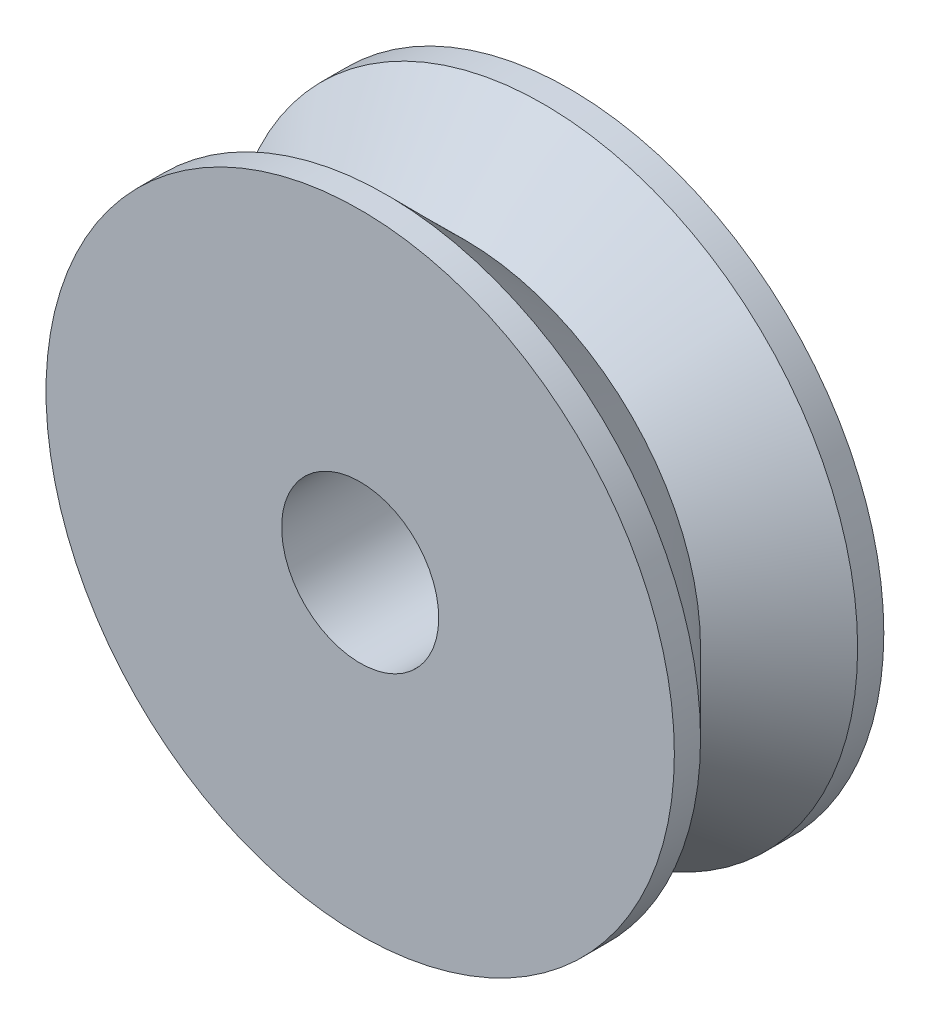
ISO-10303-21;
HEADER;
FILE_DESCRIPTION(('STEP AP214'),'2;1');
FILE_NAME('part.step','',(''),(''),'','','');
FILE_SCHEMA(('AUTOMOTIVE_DESIGN { 1 0 10303 214 1 1 1 1 }'));
ENDSEC;
DATA;
#1=APPLICATION_CONTEXT('core data for automotive mechanical design processes');
#2=APPLICATION_PROTOCOL_DEFINITION('international standard','automotive_design',2000,#1);
#3=PRODUCT_CONTEXT('',#1,'mechanical');
#4=PRODUCT('Part','Part','',(#3));
#5=PRODUCT_RELATED_PRODUCT_CATEGORY('part','',(#4));
#6=PRODUCT_DEFINITION_FORMATION('','',#4);
#7=PRODUCT_DEFINITION_CONTEXT('part definition',#1,'design');
#8=PRODUCT_DEFINITION('design','',#6,#7);
#9=PRODUCT_DEFINITION_SHAPE('','',#8);
#10=(LENGTH_UNIT() NAMED_UNIT(*) SI_UNIT(.MILLI.,.METRE.));
#11=(NAMED_UNIT(*) PLANE_ANGLE_UNIT() SI_UNIT($,.RADIAN.));
#12=(NAMED_UNIT(*) SI_UNIT($,.STERADIAN.) SOLID_ANGLE_UNIT());
#13=UNCERTAINTY_MEASURE_WITH_UNIT(LENGTH_MEASURE(1.E-05),#10,'distance_accuracy_value','');
#14=(GEOMETRIC_REPRESENTATION_CONTEXT(3) GLOBAL_UNCERTAINTY_ASSIGNED_CONTEXT((#13)) GLOBAL_UNIT_ASSIGNED_CONTEXT((#10,
#11,#12)) REPRESENTATION_CONTEXT('',''));
#15=CARTESIAN_POINT('',(0.,0.,0.));
#16=DIRECTION('',(0.,0.,1.));
#17=DIRECTION('',(1.,0.,0.));
#18=AXIS2_PLACEMENT_3D('',#15,#16,#17);
#19=CARTESIAN_POINT('',(0.,0.,0.));
#20=DIRECTION('',(0.,0.,1.));
#21=DIRECTION('',(1.,0.,0.));
#22=AXIS2_PLACEMENT_3D('',#19,#20,#21);
#23=PLANE('',#22);
#24=CARTESIAN_POINT('',(0.,0.,0.));
#25=DIRECTION('',(0.,0.,1.));
#26=DIRECTION('',(1.,0.,0.));
#27=AXIS2_PLACEMENT_3D('',#24,#25,#26);
#28=CIRCLE('',#27,5.99999999999908);
#29=CARTESIAN_POINT('',(5.99999999999908,0.,0.));
#30=VERTEX_POINT('',#29);
#31=EDGE_CURVE('E47',#30,#30,#28,.T.);
#32=ORIENTED_EDGE('',*,*,#31,.F.);
#33=EDGE_LOOP('',(#32));
#34=FACE_BOUND('',#33,.T.);
#35=CARTESIAN_POINT('',(0.,0.,0.));
#36=DIRECTION('',(0.,0.,1.));
#37=DIRECTION('',(1.,0.,0.));
#38=AXIS2_PLACEMENT_3D('',#35,#36,#37);
#39=CIRCLE('',#38,1.49999999999906);
#40=CARTESIAN_POINT('',(1.49999999999906,0.,0.));
#41=VERTEX_POINT('',#40);
#42=EDGE_CURVE('E52',#41,#41,#39,.T.);
#43=ORIENTED_EDGE('',*,*,#42,.T.);
#44=EDGE_LOOP('',(#43));
#45=FACE_BOUND('',#44,.T.);
#46=ADVANCED_FACE('F32',(#34,#45),#23,.F.);
#47=CARTESIAN_POINT('',(0.,0.,2.));
#48=DIRECTION('',(0.,0.,-1.));
#49=DIRECTION('',(-1.,0.,0.));
#50=AXIS2_PLACEMENT_3D('',#47,#48,#49);
#51=CYLINDRICAL_SURFACE('',#50,5.99999999999908);
#52=CARTESIAN_POINT('',(0.,0.,0.499999999999999));
#53=DIRECTION('',(0.,0.,1.));
#54=DIRECTION('',(1.,0.,0.));
#55=AXIS2_PLACEMENT_3D('',#52,#53,#54);
#56=CIRCLE('',#55,5.99999999999908);
#57=CARTESIAN_POINT('',(5.99999999999908,0.,0.499999999999999));
#58=VERTEX_POINT('',#57);
#59=EDGE_CURVE('E39',#58,#58,#56,.F.);
#60=ORIENTED_EDGE('',*,*,#59,.T.);
#61=EDGE_LOOP('',(#60));
#62=FACE_BOUND('',#61,.T.);
#63=ORIENTED_EDGE('',*,*,#31,.T.);
#64=EDGE_LOOP('',(#63));
#65=FACE_BOUND('',#64,.T.);
#66=ADVANCED_FACE('F77',(#62,#65),#51,.T.);
#67=CARTESIAN_POINT('',(0.,0.,2.));
#68=DIRECTION('',(0.,0.,-1.));
#69=DIRECTION('',(-1.,0.,0.));
#70=AXIS2_PLACEMENT_3D('',#67,#68,#69);
#71=CYLINDRICAL_SURFACE('',#70,1.49999999999906);
#72=ORIENTED_EDGE('',*,*,#42,.F.);
#73=EDGE_LOOP('',(#72));
#74=FACE_BOUND('',#73,.T.);
#75=CARTESIAN_POINT('',(0.,0.,4.));
#76=DIRECTION('',(0.,0.,1.));
#77=DIRECTION('',(1.,0.,0.));
#78=AXIS2_PLACEMENT_3D('',#75,#76,#77);
#79=CIRCLE('',#78,1.5);
#80=CARTESIAN_POINT('',(1.5,0.,4.));
#81=VERTEX_POINT('',#80);
#82=EDGE_CURVE('E58',#81,#81,#79,.T.);
#83=ORIENTED_EDGE('',*,*,#82,.T.);
#84=EDGE_LOOP('',(#83));
#85=FACE_BOUND('',#84,.T.);
#86=ADVANCED_FACE('F62',(#74,#85),#71,.F.);
#87=CARTESIAN_POINT('',(0.,0.,2.));
#88=DIRECTION('',(0.,0.,-1.));
#89=DIRECTION('',(-1.,0.,0.));
#90=AXIS2_PLACEMENT_3D('',#87,#88,#89);
#91=CONICAL_SURFACE('',#90,4.49999999999909,0.785398163397447);
#92=ORIENTED_EDGE('',*,*,#59,.F.);
#93=EDGE_LOOP('',(#92));
#94=FACE_BOUND('',#93,.T.);
#95=CARTESIAN_POINT('',(0.,0.,2.));
#96=DIRECTION('',(0.,0.,1.));
#97=DIRECTION('',(1.,0.,0.));
#98=AXIS2_PLACEMENT_3D('',#95,#96,#97);
#99=CIRCLE('',#98,4.49999999999909);
#100=CARTESIAN_POINT('',(4.49999999999909,0.,2.));
#101=VERTEX_POINT('',#100);
#102=EDGE_CURVE('E43',#101,#101,#99,.T.);
#103=ORIENTED_EDGE('',*,*,#102,.F.);
#104=EDGE_LOOP('',(#103));
#105=FACE_BOUND('',#104,.T.);
#106=ADVANCED_FACE('F67',(#94,#105),#91,.T.);
#107=CARTESIAN_POINT('',(0.,0.,4.));
#108=DIRECTION('',(0.,0.,1.));
#109=DIRECTION('',(1.,0.,0.));
#110=AXIS2_PLACEMENT_3D('',#107,#108,#109);
#111=PLANE('',#110);
#112=CARTESIAN_POINT('',(0.,0.,4.));
#113=DIRECTION('',(0.,0.,1.));
#114=DIRECTION('',(1.,0.,0.));
#115=AXIS2_PLACEMENT_3D('',#112,#113,#114);
#116=CIRCLE('',#115,5.99999999999908);
#117=CARTESIAN_POINT('',(5.99999999999908,0.,4.));
#118=VERTEX_POINT('',#117);
#119=EDGE_CURVE('E55',#118,#118,#116,.T.);
#120=ORIENTED_EDGE('',*,*,#119,.T.);
#121=EDGE_LOOP('',(#120));
#122=FACE_BOUND('',#121,.T.);
#123=ORIENTED_EDGE('',*,*,#82,.F.);
#124=EDGE_LOOP('',(#123));
#125=FACE_BOUND('',#124,.T.);
#126=ADVANCED_FACE('F64',(#122,#125),#111,.T.);
#127=CARTESIAN_POINT('',(0.,0.,4.));
#128=DIRECTION('',(0.,0.,-1.));
#129=DIRECTION('',(-1.,0.,0.));
#130=AXIS2_PLACEMENT_3D('',#127,#128,#129);
#131=CYLINDRICAL_SURFACE('',#130,5.99999999999908);
#132=CARTESIAN_POINT('',(0.,0.,3.5));
#133=DIRECTION('',(0.,0.,1.));
#134=DIRECTION('',(1.,0.,0.));
#135=AXIS2_PLACEMENT_3D('',#132,#133,#134);
#136=CIRCLE('',#135,5.99999999999908);
#137=CARTESIAN_POINT('',(5.99999999999908,0.,3.5));
#138=VERTEX_POINT('',#137);
#139=EDGE_CURVE('E10',#138,#138,#136,.T.);
#140=ORIENTED_EDGE('',*,*,#139,.T.);
#141=EDGE_LOOP('',(#140));
#142=FACE_BOUND('',#141,.T.);
#143=ORIENTED_EDGE('',*,*,#119,.F.);
#144=EDGE_LOOP('',(#143));
#145=FACE_BOUND('',#144,.T.);
#146=ADVANCED_FACE('F66',(#142,#145),#131,.T.);
#147=CARTESIAN_POINT('',(0.,0.,3.5));
#148=DIRECTION('',(0.,0.,1.));
#149=DIRECTION('',(1.,0.,0.));
#150=AXIS2_PLACEMENT_3D('',#147,#148,#149);
#151=CONICAL_SURFACE('',#150,5.99999999999908,0.785398163397451);
#152=ORIENTED_EDGE('',*,*,#102,.T.);
#153=EDGE_LOOP('',(#152));
#154=FACE_BOUND('',#153,.T.);
#155=ORIENTED_EDGE('',*,*,#139,.F.);
#156=EDGE_LOOP('',(#155));
#157=FACE_BOUND('',#156,.T.);
#158=ADVANCED_FACE('F34',(#154,#157),#151,.T.);
#159=CLOSED_SHELL('',(#46,#66,#86,#106,#126,#146,#158));
#160=MANIFOLD_SOLID_BREP('B2',#159);
#161=ADVANCED_BREP_SHAPE_REPRESENTATION('',(#18,#160),#14);
#162=SHAPE_DEFINITION_REPRESENTATION(#9,#161);
ENDSEC;
END-ISO-10303-21;
